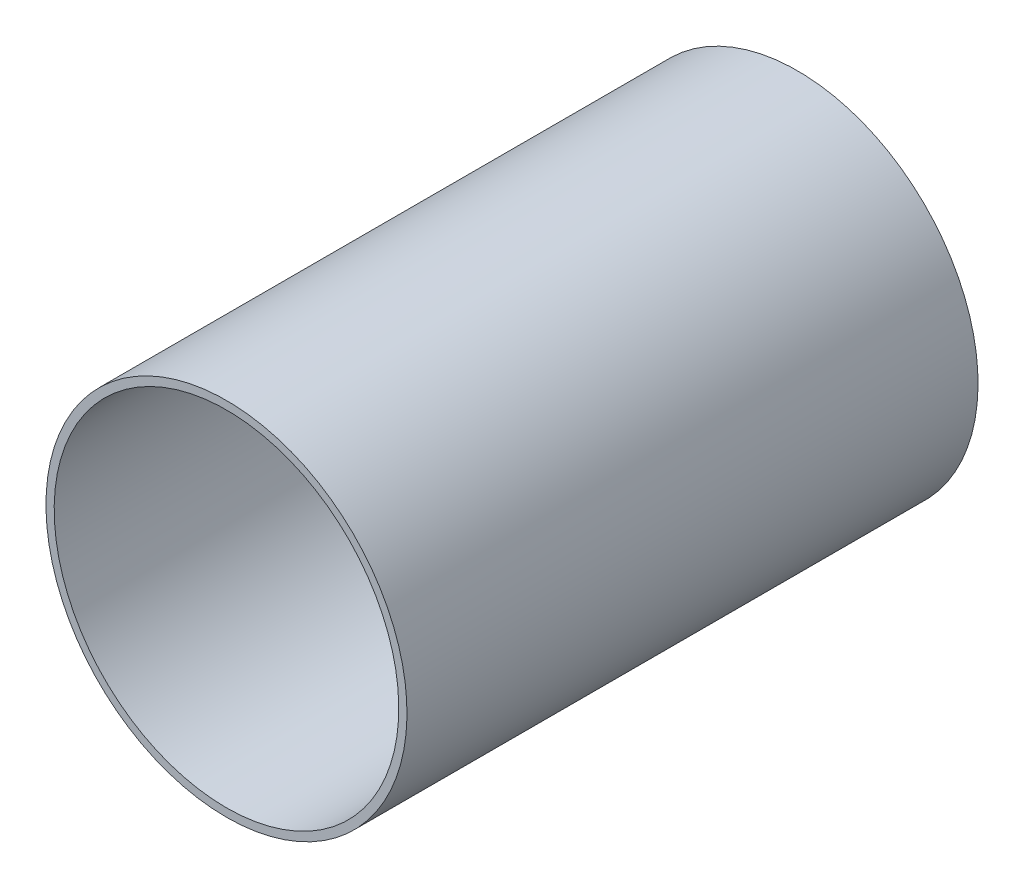
ISO-10303-21;
HEADER;
FILE_DESCRIPTION(('STEP AP214'),'2;1');
FILE_NAME('part.step','',(''),(''),'','','');
FILE_SCHEMA(('AUTOMOTIVE_DESIGN { 1 0 10303 214 1 1 1 1 }'));
ENDSEC;
DATA;
#1=APPLICATION_CONTEXT('core data for automotive mechanical design processes');
#2=APPLICATION_PROTOCOL_DEFINITION('international standard','automotive_design',2000,#1);
#3=PRODUCT_CONTEXT('',#1,'mechanical');
#4=PRODUCT('Part','Part','',(#3));
#5=PRODUCT_RELATED_PRODUCT_CATEGORY('part','',(#4));
#6=PRODUCT_DEFINITION_FORMATION('','',#4);
#7=PRODUCT_DEFINITION_CONTEXT('part definition',#1,'design');
#8=PRODUCT_DEFINITION('design','',#6,#7);
#9=PRODUCT_DEFINITION_SHAPE('','',#8);
#10=(LENGTH_UNIT() NAMED_UNIT(*) SI_UNIT(.MILLI.,.METRE.));
#11=(NAMED_UNIT(*) PLANE_ANGLE_UNIT() SI_UNIT($,.RADIAN.));
#12=(NAMED_UNIT(*) SI_UNIT($,.STERADIAN.) SOLID_ANGLE_UNIT());
#13=UNCERTAINTY_MEASURE_WITH_UNIT(LENGTH_MEASURE(1.E-05),#10,'distance_accuracy_value','');
#14=(GEOMETRIC_REPRESENTATION_CONTEXT(3) GLOBAL_UNCERTAINTY_ASSIGNED_CONTEXT((#13)) GLOBAL_UNIT_ASSIGNED_CONTEXT((#10,
#11,#12)) REPRESENTATION_CONTEXT('',''));
#15=CARTESIAN_POINT('',(0.,0.,0.));
#16=DIRECTION('',(0.,0.,1.));
#17=DIRECTION('',(1.,0.,0.));
#18=AXIS2_PLACEMENT_3D('',#15,#16,#17);
#19=CARTESIAN_POINT('',(139.452,-111.734,-0.045));
#20=DIRECTION('',(0.,0.,-1.));
#21=DIRECTION('',(0.,-1.,0.));
#22=AXIS2_PLACEMENT_3D('',#19,#20,#21);
#23=CYLINDRICAL_SURFACE('',#22,0.525);
#24=CARTESIAN_POINT('',(139.452,-111.734,-0.035));
#25=DIRECTION('',(0.,0.,-1.));
#26=DIRECTION('',(0.,-1.,0.));
#27=AXIS2_PLACEMENT_3D('',#24,#25,#26);
#28=CIRCLE('',#27,0.525);
#29=CARTESIAN_POINT('',(139.452,-112.259,-0.035));
#30=VERTEX_POINT('',#29);
#31=EDGE_CURVE('E64',#30,#30,#28,.T.);
#32=ORIENTED_EDGE('',*,*,#31,.T.);
#33=DIRECTION('',(0.,0.,1.));
#34=VECTOR('',#33,1.);
#35=CARTESIAN_POINT('',(139.452,-112.259,-0.045));
#36=LINE('',#35,#34);
#37=CARTESIAN_POINT('',(139.452,-112.259,1.705));
#38=VERTEX_POINT('',#37);
#39=EDGE_CURVE('E11',#30,#38,#36,.T.);
#40=ORIENTED_EDGE('',*,*,#39,.T.);
#41=CARTESIAN_POINT('',(139.452,-111.734,1.705));
#42=DIRECTION('',(0.,0.,-1.));
#43=DIRECTION('',(0.,-1.,0.));
#44=AXIS2_PLACEMENT_3D('',#41,#42,#43);
#45=CIRCLE('',#44,0.525);
#46=EDGE_CURVE('E25',#38,#38,#45,.T.);
#47=ORIENTED_EDGE('',*,*,#46,.F.);
#48=ORIENTED_EDGE('',*,*,#39,.F.);
#49=EDGE_LOOP('',(#32,#40,#47,#48));
#50=FACE_BOUND('',#49,.T.);
#51=ADVANCED_FACE('F17',(#50),#23,.F.);
#52=CARTESIAN_POINT('',(139.452,-112.284,1.705));
#53=DIRECTION('',(0.,0.,1.));
#54=DIRECTION('',(1.,0.,0.));
#55=AXIS2_PLACEMENT_3D('',#52,#53,#54);
#56=PLANE('',#55);
#57=ORIENTED_EDGE('',*,*,#46,.T.);
#58=EDGE_LOOP('',(#57));
#59=FACE_BOUND('',#58,.T.);
#60=CARTESIAN_POINT('',(139.452,-111.734,1.705));
#61=DIRECTION('',(0.,0.,1.));
#62=DIRECTION('',(0.,-1.,0.));
#63=AXIS2_PLACEMENT_3D('',#60,#61,#62);
#64=CIRCLE('',#63,0.55);
#65=CARTESIAN_POINT('',(139.452,-112.284,1.705));
#66=VERTEX_POINT('',#65);
#67=EDGE_CURVE('E56',#66,#66,#64,.T.);
#68=ORIENTED_EDGE('',*,*,#67,.T.);
#69=EDGE_LOOP('',(#68));
#70=FACE_BOUND('',#69,.T.);
#71=ADVANCED_FACE('F80',(#59,#70),#56,.T.);
#72=CARTESIAN_POINT('',(139.452,-112.284,-0.035));
#73=DIRECTION('',(0.,0.,1.));
#74=DIRECTION('',(1.,0.,0.));
#75=AXIS2_PLACEMENT_3D('',#72,#73,#74);
#76=PLANE('',#75);
#77=ORIENTED_EDGE('',*,*,#31,.F.);
#78=EDGE_LOOP('',(#77));
#79=FACE_BOUND('',#78,.T.);
#80=CARTESIAN_POINT('',(139.452,-111.734,-0.035));
#81=DIRECTION('',(0.,0.,1.));
#82=DIRECTION('',(0.,-1.,0.));
#83=AXIS2_PLACEMENT_3D('',#80,#81,#82);
#84=CIRCLE('',#83,0.55);
#85=CARTESIAN_POINT('',(139.452,-112.284,-0.035));
#86=VERTEX_POINT('',#85);
#87=EDGE_CURVE('E55',#86,#86,#84,.T.);
#88=ORIENTED_EDGE('',*,*,#87,.F.);
#89=EDGE_LOOP('',(#88));
#90=FACE_BOUND('',#89,.T.);
#91=ADVANCED_FACE('F77',(#79,#90),#76,.F.);
#92=CARTESIAN_POINT('',(139.452,-111.734,-0.035));
#93=DIRECTION('',(0.,0.,-1.));
#94=DIRECTION('',(0.,-1.,0.));
#95=AXIS2_PLACEMENT_3D('',#92,#93,#94);
#96=CYLINDRICAL_SURFACE('',#95,0.55);
#97=ORIENTED_EDGE('',*,*,#87,.T.);
#98=DIRECTION('',(0.,0.,1.));
#99=VECTOR('',#98,1.);
#100=CARTESIAN_POINT('',(139.452,-112.284,-0.035));
#101=LINE('',#100,#99);
#102=EDGE_CURVE('E52',#86,#66,#101,.T.);
#103=ORIENTED_EDGE('',*,*,#102,.T.);
#104=ORIENTED_EDGE('',*,*,#67,.F.);
#105=ORIENTED_EDGE('',*,*,#102,.F.);
#106=EDGE_LOOP('',(#97,#103,#104,#105));
#107=FACE_BOUND('',#106,.T.);
#108=ADVANCED_FACE('F53',(#107),#96,.T.);
#109=CLOSED_SHELL('',(#51,#71,#91,#108));
#110=MANIFOLD_SOLID_BREP('B1',#109);
#111=ADVANCED_BREP_SHAPE_REPRESENTATION('',(#18,#110),#14);
#112=SHAPE_DEFINITION_REPRESENTATION(#9,#111);
ENDSEC;
END-ISO-10303-21;
